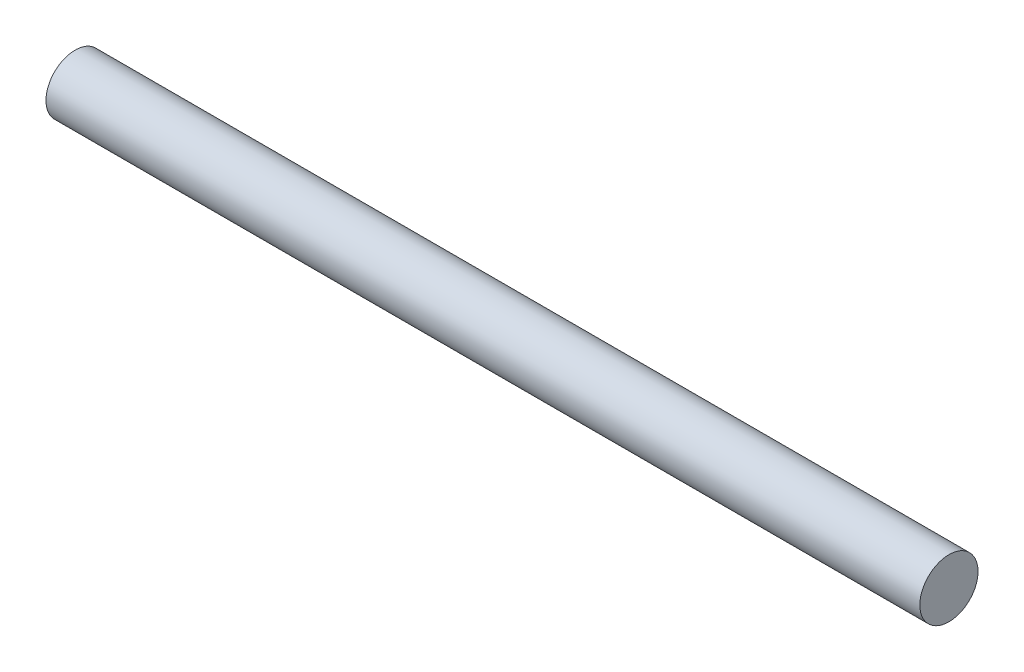
ISO-10303-21;
HEADER;
FILE_DESCRIPTION(('STEP AP214'),'2;1');
FILE_NAME('part.step','',(''),(''),'','','');
FILE_SCHEMA(('AUTOMOTIVE_DESIGN { 1 0 10303 214 1 1 1 1 }'));
ENDSEC;
DATA;
#1=APPLICATION_CONTEXT('core data for automotive mechanical design processes');
#2=APPLICATION_PROTOCOL_DEFINITION('international standard','automotive_design',2000,#1);
#3=PRODUCT_CONTEXT('',#1,'mechanical');
#4=PRODUCT('Part','Part','',(#3));
#5=PRODUCT_RELATED_PRODUCT_CATEGORY('part','',(#4));
#6=PRODUCT_DEFINITION_FORMATION('','',#4);
#7=PRODUCT_DEFINITION_CONTEXT('part definition',#1,'design');
#8=PRODUCT_DEFINITION('design','',#6,#7);
#9=PRODUCT_DEFINITION_SHAPE('','',#8);
#10=(LENGTH_UNIT() NAMED_UNIT(*) SI_UNIT(.MILLI.,.METRE.));
#11=(NAMED_UNIT(*) PLANE_ANGLE_UNIT() SI_UNIT($,.RADIAN.));
#12=(NAMED_UNIT(*) SI_UNIT($,.STERADIAN.) SOLID_ANGLE_UNIT());
#13=UNCERTAINTY_MEASURE_WITH_UNIT(LENGTH_MEASURE(1.E-05),#10,'distance_accuracy_value','');
#14=(GEOMETRIC_REPRESENTATION_CONTEXT(3) GLOBAL_UNCERTAINTY_ASSIGNED_CONTEXT((#13)) GLOBAL_UNIT_ASSIGNED_CONTEXT((#10,
#11,#12)) REPRESENTATION_CONTEXT('',''));
#15=CARTESIAN_POINT('',(0.,0.,0.));
#16=DIRECTION('',(0.,0.,1.));
#17=DIRECTION('',(1.,0.,0.));
#18=AXIS2_PLACEMENT_3D('',#15,#16,#17);
#19=CARTESIAN_POINT('',(-34.7204610951009,0.,-5.99999999999997));
#20=DIRECTION('',(1.,0.,0.));
#21=DIRECTION('',(0.,0.,-1.));
#22=AXIS2_PLACEMENT_3D('',#19,#20,#21);
#23=PLANE('',#22);
#24=CARTESIAN_POINT('',(-34.7204610951009,0.,-5.99999999999997));
#25=DIRECTION('',(-1.,0.,0.));
#26=DIRECTION('',(0.,0.,1.));
#27=AXIS2_PLACEMENT_3D('',#24,#25,#26);
#28=CIRCLE('',#27,6.00000000000003);
#29=CARTESIAN_POINT('',(-34.7204610951009,0.,0.));
#30=VERTEX_POINT('',#29);
#31=EDGE_CURVE('E44',#30,#30,#28,.T.);
#32=ORIENTED_EDGE('',*,*,#31,.T.);
#33=EDGE_LOOP('',(#32));
#34=FACE_BOUND('',#33,.T.);
#35=ADVANCED_FACE('F37',(#34),#23,.F.);
#36=CARTESIAN_POINT('',(145.449538904899,0.,-5.99999999999997));
#37=DIRECTION('',(-1.,0.,0.));
#38=DIRECTION('',(0.,0.,1.));
#39=AXIS2_PLACEMENT_3D('',#36,#37,#38);
#40=PLANE('',#39);
#41=CARTESIAN_POINT('',(145.449538904899,0.,-5.99999999999997));
#42=DIRECTION('',(-1.,0.,0.));
#43=DIRECTION('',(0.,0.,1.));
#44=AXIS2_PLACEMENT_3D('',#41,#42,#43);
#45=CIRCLE('',#44,6.00000000000002);
#46=CARTESIAN_POINT('',(145.449538904899,0.,0.));
#47=VERTEX_POINT('',#46);
#48=EDGE_CURVE('E10',#47,#47,#45,.T.);
#49=ORIENTED_EDGE('',*,*,#48,.F.);
#50=EDGE_LOOP('',(#49));
#51=FACE_BOUND('',#50,.T.);
#52=ADVANCED_FACE('F54',(#51),#40,.F.);
#53=CARTESIAN_POINT('',(-34.7204610951009,0.,-5.99999999999997));
#54=DIRECTION('',(-1.,0.,0.));
#55=DIRECTION('',(0.,0.,1.));
#56=AXIS2_PLACEMENT_3D('',#53,#54,#55);
#57=CYLINDRICAL_SURFACE('',#56,6.00000000000003);
#58=ORIENTED_EDGE('',*,*,#31,.F.);
#59=EDGE_LOOP('',(#58));
#60=FACE_BOUND('',#59,.T.);
#61=ORIENTED_EDGE('',*,*,#48,.T.);
#62=EDGE_LOOP('',(#61));
#63=FACE_BOUND('',#62,.T.);
#64=ADVANCED_FACE('F52',(#60,#63),#57,.T.);
#65=CLOSED_SHELL('',(#35,#52,#64));
#66=MANIFOLD_SOLID_BREP('B2',#65);
#67=ADVANCED_BREP_SHAPE_REPRESENTATION('',(#18,#66),#14);
#68=SHAPE_DEFINITION_REPRESENTATION(#9,#67);
ENDSEC;
END-ISO-10303-21;
